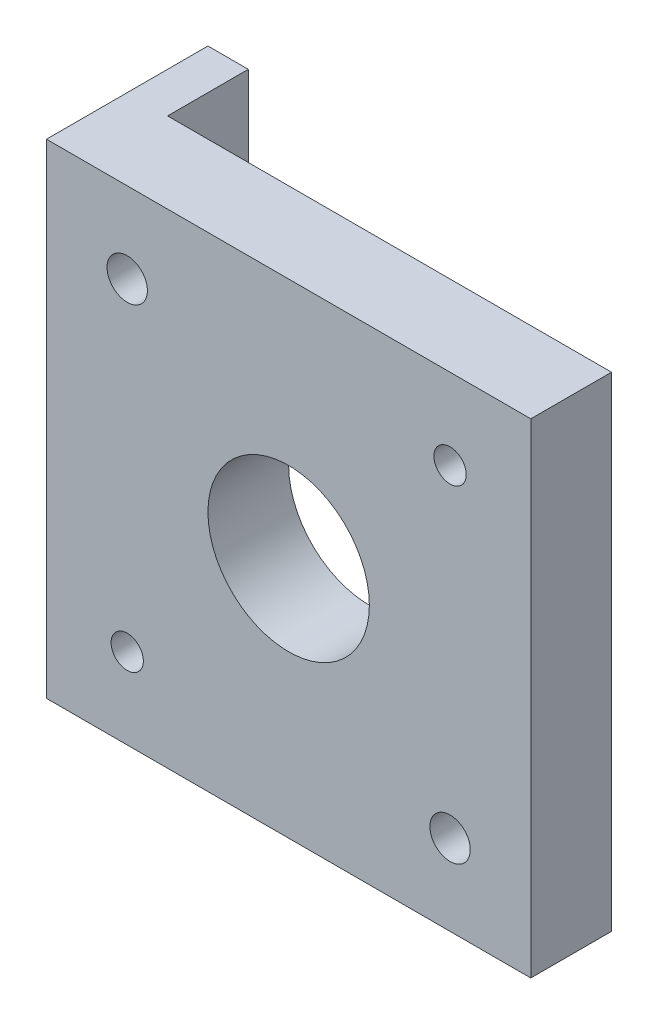
ISO-10303-21;
HEADER;
FILE_DESCRIPTION(('STEP AP214'),'2;1');
FILE_NAME('part.step','',(''),(''),'','','');
FILE_SCHEMA(('AUTOMOTIVE_DESIGN { 1 0 10303 214 1 1 1 1 }'));
ENDSEC;
DATA;
#1=APPLICATION_CONTEXT('core data for automotive mechanical design processes');
#2=APPLICATION_PROTOCOL_DEFINITION('international standard','automotive_design',2000,#1);
#3=PRODUCT_CONTEXT('',#1,'mechanical');
#4=PRODUCT('Part','Part','',(#3));
#5=PRODUCT_RELATED_PRODUCT_CATEGORY('part','',(#4));
#6=PRODUCT_DEFINITION_FORMATION('','',#4);
#7=PRODUCT_DEFINITION_CONTEXT('part definition',#1,'design');
#8=PRODUCT_DEFINITION('design','',#6,#7);
#9=PRODUCT_DEFINITION_SHAPE('','',#8);
#10=(LENGTH_UNIT() NAMED_UNIT(*) SI_UNIT(.MILLI.,.METRE.));
#11=(NAMED_UNIT(*) PLANE_ANGLE_UNIT() SI_UNIT($,.RADIAN.));
#12=(NAMED_UNIT(*) SI_UNIT($,.STERADIAN.) SOLID_ANGLE_UNIT());
#13=UNCERTAINTY_MEASURE_WITH_UNIT(LENGTH_MEASURE(1.E-05),#10,'distance_accuracy_value','');
#14=(GEOMETRIC_REPRESENTATION_CONTEXT(3) GLOBAL_UNCERTAINTY_ASSIGNED_CONTEXT((#13)) GLOBAL_UNIT_ASSIGNED_CONTEXT((#10,
#11,#12)) REPRESENTATION_CONTEXT('',''));
#15=CARTESIAN_POINT('',(0.,0.,0.));
#16=DIRECTION('',(0.,0.,1.));
#17=DIRECTION('',(1.,0.,0.));
#18=AXIS2_PLACEMENT_3D('',#15,#16,#17);
#19=CARTESIAN_POINT('',(0.,60.,10.));
#20=DIRECTION('',(0.,0.,-1.));
#21=DIRECTION('',(-1.,0.,0.));
#22=AXIS2_PLACEMENT_3D('',#19,#20,#21);
#23=PLANE('',#22);
#24=CARTESIAN_POINT('',(9.99999999999999,10.,10.));
#25=DIRECTION('',(0.,0.,1.));
#26=DIRECTION('',(1.,0.,0.));
#27=AXIS2_PLACEMENT_3D('',#24,#25,#26);
#28=CIRCLE('',#27,2.);
#29=CARTESIAN_POINT('',(12.,10.,10.));
#30=VERTEX_POINT('',#29);
#31=EDGE_CURVE('E363',#30,#30,#28,.T.);
#32=ORIENTED_EDGE('',*,*,#31,.F.);
#33=EDGE_LOOP('',(#32));
#34=FACE_BOUND('',#33,.T.);
#35=CARTESIAN_POINT('',(50.,50.,10.));
#36=DIRECTION('',(0.,0.,1.));
#37=DIRECTION('',(1.,0.,0.));
#38=AXIS2_PLACEMENT_3D('',#35,#36,#37);
#39=CIRCLE('',#38,2.);
#40=CARTESIAN_POINT('',(52.,50.,10.));
#41=VERTEX_POINT('',#40);
#42=EDGE_CURVE('E174',#41,#41,#39,.T.);
#43=ORIENTED_EDGE('',*,*,#42,.F.);
#44=EDGE_LOOP('',(#43));
#45=FACE_BOUND('',#44,.T.);
#46=CARTESIAN_POINT('',(9.99999999999993,49.9999999999999,10.000000000001));
#47=DIRECTION('',(0.,0.,-1.));
#48=DIRECTION('',(0.99716147316356,-0.0752927382838364,0.));
#49=AXIS2_PLACEMENT_3D('',#46,#47,#48);
#50=CIRCLE('',#49,2.5);
#51=CARTESIAN_POINT('',(12.4929036829088,49.8117681542903,10.000000000001));
#52=VERTEX_POINT('',#51);
#53=EDGE_CURVE('E171',#52,#52,#50,.T.);
#54=ORIENTED_EDGE('',*,*,#53,.T.);
#55=EDGE_LOOP('',(#54));
#56=FACE_BOUND('',#55,.T.);
#57=CARTESIAN_POINT('',(30.,30.,10.));
#58=DIRECTION('',(0.,0.,-1.));
#59=DIRECTION('',(-1.,0.,0.));
#60=AXIS2_PLACEMENT_3D('',#57,#58,#59);
#61=CIRCLE('',#60,10.);
#62=CARTESIAN_POINT('',(20.,30.,10.));
#63=VERTEX_POINT('',#62);
#64=EDGE_CURVE('E181',#63,#63,#61,.T.);
#65=ORIENTED_EDGE('',*,*,#64,.T.);
#66=EDGE_LOOP('',(#65));
#67=FACE_BOUND('',#66,.T.);
#68=DIRECTION('',(0.,-1.,0.));
#69=VECTOR('',#68,1.);
#70=CARTESIAN_POINT('',(0.,0.,10.));
#71=LINE('',#70,#69);
#72=CARTESIAN_POINT('',(0.,60.,10.));
#73=VERTEX_POINT('',#72);
#74=CARTESIAN_POINT('',(0.,0.,10.));
#75=VERTEX_POINT('',#74);
#76=EDGE_CURVE('E136',#73,#75,#71,.T.);
#77=ORIENTED_EDGE('',*,*,#76,.T.);
#78=DIRECTION('',(1.,0.,0.));
#79=VECTOR('',#78,1.);
#80=CARTESIAN_POINT('',(0.,0.,10.));
#81=LINE('',#80,#79);
#82=CARTESIAN_POINT('',(60.,0.,10.));
#83=VERTEX_POINT('',#82);
#84=EDGE_CURVE('E83',#75,#83,#81,.T.);
#85=ORIENTED_EDGE('',*,*,#84,.T.);
#86=DIRECTION('',(0.,1.,0.));
#87=VECTOR('',#86,1.);
#88=CARTESIAN_POINT('',(60.,0.,10.));
#89=LINE('',#88,#87);
#90=CARTESIAN_POINT('',(60.,60.,10.));
#91=VERTEX_POINT('',#90);
#92=EDGE_CURVE('E140',#83,#91,#89,.T.);
#93=ORIENTED_EDGE('',*,*,#92,.T.);
#94=DIRECTION('',(-1.,0.,0.));
#95=VECTOR('',#94,1.);
#96=CARTESIAN_POINT('',(0.,60.,10.));
#97=LINE('',#96,#95);
#98=EDGE_CURVE('E60',#91,#73,#97,.T.);
#99=ORIENTED_EDGE('',*,*,#98,.T.);
#100=EDGE_LOOP('',(#77,#85,#93,#99));
#101=FACE_BOUND('',#100,.T.);
#102=CARTESIAN_POINT('',(50.,10.,9.99999999999998));
#103=DIRECTION('',(0.,0.,-1.));
#104=DIRECTION('',(-0.107409040111746,0.994214915449509,0.));
#105=AXIS2_PLACEMENT_3D('',#102,#103,#104);
#106=CIRCLE('',#105,2.5);
#107=CARTESIAN_POINT('',(50.2685226002794,7.51446271137626,9.99999999999998));
#108=VERTEX_POINT('',#107);
#109=EDGE_CURVE('E165',#108,#108,#106,.T.);
#110=ORIENTED_EDGE('',*,*,#109,.T.);
#111=EDGE_LOOP('',(#110));
#112=FACE_BOUND('',#111,.T.);
#113=ADVANCED_FACE('F34',(#34,#45,#56,#67,#101,#112),#23,.F.);
#114=CARTESIAN_POINT('',(0.,60.,0.));
#115=DIRECTION('',(0.,0.,-1.));
#116=DIRECTION('',(-1.,0.,0.));
#117=AXIS2_PLACEMENT_3D('',#114,#115,#116);
#118=PLANE('',#117);
#119=CARTESIAN_POINT('',(9.99999999999999,10.,0.));
#120=DIRECTION('',(0.,0.,-1.));
#121=DIRECTION('',(-1.,0.,0.));
#122=AXIS2_PLACEMENT_3D('',#119,#120,#121);
#123=CIRCLE('',#122,2.);
#124=CARTESIAN_POINT('',(12.,10.,0.));
#125=VERTEX_POINT('',#124);
#126=EDGE_CURVE('E38',#125,#125,#123,.T.);
#127=ORIENTED_EDGE('',*,*,#126,.F.);
#128=EDGE_LOOP('',(#127));
#129=FACE_BOUND('',#128,.T.);
#130=CARTESIAN_POINT('',(50.,50.,0.));
#131=DIRECTION('',(0.,0.,-1.));
#132=DIRECTION('',(-1.,0.,0.));
#133=AXIS2_PLACEMENT_3D('',#130,#131,#132);
#134=CIRCLE('',#133,2.);
#135=CARTESIAN_POINT('',(52.,50.,0.));
#136=VERTEX_POINT('',#135);
#137=EDGE_CURVE('E168',#136,#136,#134,.T.);
#138=ORIENTED_EDGE('',*,*,#137,.F.);
#139=EDGE_LOOP('',(#138));
#140=FACE_BOUND('',#139,.T.);
#141=CARTESIAN_POINT('',(9.99999999999993,49.9999999999999,0.));
#142=DIRECTION('',(0.,0.,-1.));
#143=DIRECTION('',(-1.,0.,0.));
#144=AXIS2_PLACEMENT_3D('',#141,#142,#143);
#145=CIRCLE('',#144,2.5);
#146=CARTESIAN_POINT('',(7.49999999999993,49.9999999999999,0.));
#147=VERTEX_POINT('',#146);
#148=EDGE_CURVE('E180',#147,#147,#145,.F.);
#149=ORIENTED_EDGE('',*,*,#148,.T.);
#150=EDGE_LOOP('',(#149));
#151=FACE_BOUND('',#150,.T.);
#152=CARTESIAN_POINT('',(30.,30.,0.));
#153=DIRECTION('',(0.,0.,-1.));
#154=DIRECTION('',(-1.,0.,0.));
#155=AXIS2_PLACEMENT_3D('',#152,#153,#154);
#156=CIRCLE('',#155,10.);
#157=CARTESIAN_POINT('',(20.,30.,0.));
#158=VERTEX_POINT('',#157);
#159=EDGE_CURVE('E185',#158,#158,#156,.T.);
#160=ORIENTED_EDGE('',*,*,#159,.F.);
#161=EDGE_LOOP('',(#160));
#162=FACE_BOUND('',#161,.T.);
#163=DIRECTION('',(0.,-1.,0.));
#164=VECTOR('',#163,1.);
#165=CARTESIAN_POINT('',(5.,60.,0.));
#166=LINE('',#165,#164);
#167=CARTESIAN_POINT('',(4.99999999999999,60.,0.));
#168=VERTEX_POINT('',#167);
#169=CARTESIAN_POINT('',(4.99999999999999,0.,0.));
#170=VERTEX_POINT('',#169);
#171=EDGE_CURVE('E51',#168,#170,#166,.T.);
#172=ORIENTED_EDGE('',*,*,#171,.F.);
#173=DIRECTION('',(-1.,0.,0.));
#174=VECTOR('',#173,1.);
#175=CARTESIAN_POINT('',(0.,60.,0.));
#176=LINE('',#175,#174);
#177=CARTESIAN_POINT('',(60.,60.,0.));
#178=VERTEX_POINT('',#177);
#179=EDGE_CURVE('E138',#178,#168,#176,.T.);
#180=ORIENTED_EDGE('',*,*,#179,.F.);
#181=DIRECTION('',(0.,1.,0.));
#182=VECTOR('',#181,1.);
#183=CARTESIAN_POINT('',(60.,0.,0.));
#184=LINE('',#183,#182);
#185=CARTESIAN_POINT('',(60.,0.,0.));
#186=VERTEX_POINT('',#185);
#187=EDGE_CURVE('E76',#186,#178,#184,.T.);
#188=ORIENTED_EDGE('',*,*,#187,.F.);
#189=DIRECTION('',(1.,0.,0.));
#190=VECTOR('',#189,1.);
#191=CARTESIAN_POINT('',(0.,0.,0.));
#192=LINE('',#191,#190);
#193=EDGE_CURVE('E119',#170,#186,#192,.T.);
#194=ORIENTED_EDGE('',*,*,#193,.F.);
#195=EDGE_LOOP('',(#172,#180,#188,#194));
#196=FACE_BOUND('',#195,.T.);
#197=CARTESIAN_POINT('',(50.,10.,0.));
#198=DIRECTION('',(0.,0.,-1.));
#199=DIRECTION('',(-1.,0.,0.));
#200=AXIS2_PLACEMENT_3D('',#197,#198,#199);
#201=CIRCLE('',#200,2.5);
#202=CARTESIAN_POINT('',(50.2685226002794,7.51446271137626,0.));
#203=VERTEX_POINT('',#202);
#204=EDGE_CURVE('E167',#203,#203,#201,.F.);
#205=ORIENTED_EDGE('',*,*,#204,.T.);
#206=EDGE_LOOP('',(#205));
#207=FACE_BOUND('',#206,.T.);
#208=ADVANCED_FACE('F155',(#129,#140,#151,#162,#196,#207),#118,.T.);
#209=CARTESIAN_POINT('',(0.,0.,10.));
#210=DIRECTION('',(1.,0.,0.));
#211=DIRECTION('',(0.,1.,0.));
#212=AXIS2_PLACEMENT_3D('',#209,#210,#211);
#213=PLANE('',#212);
#214=CARTESIAN_POINT('',(0.,10.,-6.));
#215=DIRECTION('',(-1.,0.,0.));
#216=DIRECTION('',(0.,0.,1.));
#217=AXIS2_PLACEMENT_3D('',#214,#215,#216);
#218=CIRCLE('',#217,2.);
#219=CARTESIAN_POINT('',(0.,10.,-4.));
#220=VERTEX_POINT('',#219);
#221=EDGE_CURVE('E184',#220,#220,#218,.T.);
#222=ORIENTED_EDGE('',*,*,#221,.F.);
#223=EDGE_LOOP('',(#222));
#224=FACE_BOUND('',#223,.T.);
#225=CARTESIAN_POINT('',(0.,50.,-6.));
#226=DIRECTION('',(-1.,0.,0.));
#227=DIRECTION('',(0.,0.,1.));
#228=AXIS2_PLACEMENT_3D('',#225,#226,#227);
#229=CIRCLE('',#228,2.);
#230=CARTESIAN_POINT('',(0.,50.,-4.));
#231=VERTEX_POINT('',#230);
#232=EDGE_CURVE('E191',#231,#231,#229,.T.);
#233=ORIENTED_EDGE('',*,*,#232,.F.);
#234=EDGE_LOOP('',(#233));
#235=FACE_BOUND('',#234,.T.);
#236=DIRECTION('',(0.,0.,-1.));
#237=VECTOR('',#236,1.);
#238=CARTESIAN_POINT('',(0.,60.,10.));
#239=LINE('',#238,#237);
#240=CARTESIAN_POINT('',(0.,60.,-10.));
#241=VERTEX_POINT('',#240);
#242=EDGE_CURVE('E142',#73,#241,#239,.T.);
#243=ORIENTED_EDGE('',*,*,#242,.T.);
#244=DIRECTION('',(0.,1.,0.));
#245=VECTOR('',#244,1.);
#246=CARTESIAN_POINT('',(0.,60.,-10.));
#247=LINE('',#246,#245);
#248=CARTESIAN_POINT('',(0.,0.,-10.));
#249=VERTEX_POINT('',#248);
#250=EDGE_CURVE('E107',#249,#241,#247,.T.);
#251=ORIENTED_EDGE('',*,*,#250,.F.);
#252=DIRECTION('',(0.,0.,-1.));
#253=VECTOR('',#252,1.);
#254=CARTESIAN_POINT('',(0.,0.,10.));
#255=LINE('',#254,#253);
#256=EDGE_CURVE('E11',#75,#249,#255,.T.);
#257=ORIENTED_EDGE('',*,*,#256,.F.);
#258=ORIENTED_EDGE('',*,*,#76,.F.);
#259=EDGE_LOOP('',(#243,#251,#257,#258));
#260=FACE_BOUND('',#259,.T.);
#261=ADVANCED_FACE('F36',(#224,#235,#260),#213,.F.);
#262=CARTESIAN_POINT('',(0.,0.,10.));
#263=DIRECTION('',(0.,1.,0.));
#264=DIRECTION('',(0.,0.,1.));
#265=AXIS2_PLACEMENT_3D('',#262,#263,#264);
#266=PLANE('',#265);
#267=ORIENTED_EDGE('',*,*,#256,.T.);
#268=DIRECTION('',(-1.,0.,0.));
#269=VECTOR('',#268,1.);
#270=CARTESIAN_POINT('',(4.99999999999999,0.,-10.));
#271=LINE('',#270,#269);
#272=CARTESIAN_POINT('',(4.99999999999999,0.,-10.));
#273=VERTEX_POINT('',#272);
#274=EDGE_CURVE('E98',#273,#249,#271,.T.);
#275=ORIENTED_EDGE('',*,*,#274,.F.);
#276=DIRECTION('',(0.,0.,1.));
#277=VECTOR('',#276,1.);
#278=CARTESIAN_POINT('',(4.99999999999999,0.,-10.));
#279=LINE('',#278,#277);
#280=EDGE_CURVE('E102',#273,#170,#279,.T.);
#281=ORIENTED_EDGE('',*,*,#280,.T.);
#282=ORIENTED_EDGE('',*,*,#193,.T.);
#283=DIRECTION('',(0.,0.,-1.));
#284=VECTOR('',#283,1.);
#285=CARTESIAN_POINT('',(60.,0.,10.));
#286=LINE('',#285,#284);
#287=EDGE_CURVE('E43',#83,#186,#286,.T.);
#288=ORIENTED_EDGE('',*,*,#287,.F.);
#289=ORIENTED_EDGE('',*,*,#84,.F.);
#290=EDGE_LOOP('',(#267,#275,#281,#282,#288,#289));
#291=FACE_BOUND('',#290,.T.);
#292=ADVANCED_FACE('F100',(#291),#266,.F.);
#293=CARTESIAN_POINT('',(60.,0.,10.));
#294=DIRECTION('',(-1.,0.,0.));
#295=DIRECTION('',(0.,-1.,0.));
#296=AXIS2_PLACEMENT_3D('',#293,#294,#295);
#297=PLANE('',#296);
#298=ORIENTED_EDGE('',*,*,#187,.T.);
#299=DIRECTION('',(0.,0.,-1.));
#300=VECTOR('',#299,1.);
#301=CARTESIAN_POINT('',(60.,60.,10.));
#302=LINE('',#301,#300);
#303=EDGE_CURVE('E150',#91,#178,#302,.T.);
#304=ORIENTED_EDGE('',*,*,#303,.F.);
#305=ORIENTED_EDGE('',*,*,#92,.F.);
#306=ORIENTED_EDGE('',*,*,#287,.T.);
#307=EDGE_LOOP('',(#298,#304,#305,#306));
#308=FACE_BOUND('',#307,.T.);
#309=ADVANCED_FACE('F158',(#308),#297,.F.);
#310=CARTESIAN_POINT('',(0.,60.,10.));
#311=DIRECTION('',(0.,-1.,0.));
#312=DIRECTION('',(0.,0.,-1.));
#313=AXIS2_PLACEMENT_3D('',#310,#311,#312);
#314=PLANE('',#313);
#315=ORIENTED_EDGE('',*,*,#179,.T.);
#316=DIRECTION('',(0.,0.,1.));
#317=VECTOR('',#316,1.);
#318=CARTESIAN_POINT('',(5.,60.,-10.));
#319=LINE('',#318,#317);
#320=CARTESIAN_POINT('',(5.,60.,-10.));
#321=VERTEX_POINT('',#320);
#322=EDGE_CURVE('E120',#321,#168,#319,.T.);
#323=ORIENTED_EDGE('',*,*,#322,.F.);
#324=DIRECTION('',(1.,0.,0.));
#325=VECTOR('',#324,1.);
#326=CARTESIAN_POINT('',(5.,60.,-10.));
#327=LINE('',#326,#325);
#328=EDGE_CURVE('E113',#241,#321,#327,.T.);
#329=ORIENTED_EDGE('',*,*,#328,.F.);
#330=ORIENTED_EDGE('',*,*,#242,.F.);
#331=ORIENTED_EDGE('',*,*,#98,.F.);
#332=ORIENTED_EDGE('',*,*,#303,.T.);
#333=EDGE_LOOP('',(#315,#323,#329,#330,#331,#332));
#334=FACE_BOUND('',#333,.T.);
#335=ADVANCED_FACE('F154',(#334),#314,.F.);
#336=CARTESIAN_POINT('',(5.,60.,-10.));
#337=DIRECTION('',(-1.,0.,0.));
#338=DIRECTION('',(0.,-1.,0.));
#339=AXIS2_PLACEMENT_3D('',#336,#337,#338);
#340=PLANE('',#339);
#341=CARTESIAN_POINT('',(4.99999999999999,10.,-6.));
#342=DIRECTION('',(-1.,0.,0.));
#343=DIRECTION('',(0.,-1.,0.));
#344=AXIS2_PLACEMENT_3D('',#341,#342,#343);
#345=CIRCLE('',#344,2.);
#346=CARTESIAN_POINT('',(4.99999999999999,10.,-4.));
#347=VERTEX_POINT('',#346);
#348=EDGE_CURVE('E190',#347,#347,#345,.T.);
#349=ORIENTED_EDGE('',*,*,#348,.T.);
#350=EDGE_LOOP('',(#349));
#351=FACE_BOUND('',#350,.T.);
#352=CARTESIAN_POINT('',(5.,50.,-6.));
#353=DIRECTION('',(-1.,0.,0.));
#354=DIRECTION('',(0.,-1.,0.));
#355=AXIS2_PLACEMENT_3D('',#352,#353,#354);
#356=CIRCLE('',#355,2.);
#357=CARTESIAN_POINT('',(5.,50.,-4.));
#358=VERTEX_POINT('',#357);
#359=EDGE_CURVE('E130',#358,#358,#356,.T.);
#360=ORIENTED_EDGE('',*,*,#359,.T.);
#361=EDGE_LOOP('',(#360));
#362=FACE_BOUND('',#361,.T.);
#363=ORIENTED_EDGE('',*,*,#171,.T.);
#364=ORIENTED_EDGE('',*,*,#280,.F.);
#365=DIRECTION('',(0.,-1.,0.));
#366=VECTOR('',#365,1.);
#367=CARTESIAN_POINT('',(5.,60.,-10.));
#368=LINE('',#367,#366);
#369=EDGE_CURVE('E108',#321,#273,#368,.T.);
#370=ORIENTED_EDGE('',*,*,#369,.F.);
#371=ORIENTED_EDGE('',*,*,#322,.T.);
#372=EDGE_LOOP('',(#363,#364,#370,#371));
#373=FACE_BOUND('',#372,.T.);
#374=ADVANCED_FACE('F118',(#351,#362,#373),#340,.F.);
#375=CARTESIAN_POINT('',(4.99999999999999,0.,-10.));
#376=DIRECTION('',(0.,0.,-1.));
#377=DIRECTION('',(-1.,0.,0.));
#378=AXIS2_PLACEMENT_3D('',#375,#376,#377);
#379=PLANE('',#378);
#380=ORIENTED_EDGE('',*,*,#369,.T.);
#381=ORIENTED_EDGE('',*,*,#274,.T.);
#382=ORIENTED_EDGE('',*,*,#250,.T.);
#383=ORIENTED_EDGE('',*,*,#328,.T.);
#384=EDGE_LOOP('',(#380,#381,#382,#383));
#385=FACE_BOUND('',#384,.T.);
#386=ADVANCED_FACE('F111',(#385),#379,.T.);
#387=CARTESIAN_POINT('',(60.000025,50.,-6.));
#388=DIRECTION('',(-1.,0.,0.));
#389=DIRECTION('',(0.,0.,1.));
#390=AXIS2_PLACEMENT_3D('',#387,#388,#389);
#391=CYLINDRICAL_SURFACE('',#390,2.);
#392=CARTESIAN_POINT('',(0.,50.,-4.));
#393=CARTESIAN_POINT('',(0.0520833333333322,50.,-4.));
#394=CARTESIAN_POINT('',(0.104166666666664,50.,-4.));
#395=CARTESIAN_POINT('',(0.208333333333331,50.,-4.));
#396=CARTESIAN_POINT('',(0.260416666666666,50.,-4.));
#397=CARTESIAN_POINT('',(0.364583333333335,50.,-4.));
#398=CARTESIAN_POINT('',(0.416666666666669,50.,-4.));
#399=CARTESIAN_POINT('',(0.520833333333336,50.,-4.));
#400=CARTESIAN_POINT('',(0.572916666666668,50.,-4.));
#401=CARTESIAN_POINT('',(0.677083333333333,50.,-4.));
#402=CARTESIAN_POINT('',(0.729166666666665,50.,-4.));
#403=CARTESIAN_POINT('',(0.833333333333332,50.,-4.));
#404=CARTESIAN_POINT('',(0.885416666666666,50.,-4.));
#405=CARTESIAN_POINT('',(0.989583333333335,50.,-4.));
#406=CARTESIAN_POINT('',(1.04166666666667,50.,-4.));
#407=CARTESIAN_POINT('',(1.14583333333334,50.,-4.));
#408=CARTESIAN_POINT('',(1.19791666666667,50.,-4.));
#409=CARTESIAN_POINT('',(1.30208333333333,50.,-4.));
#410=CARTESIAN_POINT('',(1.35416666666667,50.,-4.));
#411=CARTESIAN_POINT('',(1.45833333333333,50.,-4.));
#412=CARTESIAN_POINT('',(1.51041666666667,50.,-4.));
#413=CARTESIAN_POINT('',(1.61458333333334,50.,-4.));
#414=CARTESIAN_POINT('',(1.66666666666667,50.,-4.));
#415=CARTESIAN_POINT('',(1.77083333333334,50.,-4.));
#416=CARTESIAN_POINT('',(1.82291666666667,50.,-4.));
#417=CARTESIAN_POINT('',(1.92708333333333,50.,-4.));
#418=CARTESIAN_POINT('',(1.97916666666667,50.,-4.));
#419=CARTESIAN_POINT('',(2.08333333333333,50.,-4.));
#420=CARTESIAN_POINT('',(2.13541666666667,50.,-4.));
#421=CARTESIAN_POINT('',(2.23958333333334,50.,-4.));
#422=CARTESIAN_POINT('',(2.29166666666667,50.,-4.));
#423=CARTESIAN_POINT('',(2.39583333333334,50.,-4.));
#424=CARTESIAN_POINT('',(2.44791666666667,50.,-4.));
#425=CARTESIAN_POINT('',(2.55208333333333,50.,-4.));
#426=CARTESIAN_POINT('',(2.60416666666667,50.,-4.));
#427=CARTESIAN_POINT('',(2.70833333333333,50.,-4.));
#428=CARTESIAN_POINT('',(2.76041666666667,50.,-4.));
#429=CARTESIAN_POINT('',(2.86458333333334,50.,-4.));
#430=CARTESIAN_POINT('',(2.91666666666667,50.,-4.));
#431=CARTESIAN_POINT('',(3.02083333333334,50.,-4.));
#432=CARTESIAN_POINT('',(3.07291666666667,50.,-4.));
#433=CARTESIAN_POINT('',(3.17708333333334,50.,-4.));
#434=CARTESIAN_POINT('',(3.22916666666667,50.,-4.));
#435=CARTESIAN_POINT('',(3.33333333333333,50.,-4.));
#436=CARTESIAN_POINT('',(3.38541666666667,50.,-4.));
#437=CARTESIAN_POINT('',(3.48958333333334,50.,-4.));
#438=CARTESIAN_POINT('',(3.54166666666667,50.,-4.));
#439=CARTESIAN_POINT('',(3.64583333333334,50.,-4.));
#440=CARTESIAN_POINT('',(3.69791666666667,50.,-4.));
#441=CARTESIAN_POINT('',(3.80208333333334,50.,-4.));
#442=CARTESIAN_POINT('',(3.85416666666667,50.,-4.));
#443=CARTESIAN_POINT('',(3.95833333333333,50.,-4.));
#444=CARTESIAN_POINT('',(4.01041666666667,50.,-4.));
#445=CARTESIAN_POINT('',(4.11458333333334,50.,-4.));
#446=CARTESIAN_POINT('',(4.16666666666667,50.,-4.));
#447=CARTESIAN_POINT('',(4.27083333333334,50.,-4.));
#448=CARTESIAN_POINT('',(4.32291666666667,50.,-4.));
#449=CARTESIAN_POINT('',(4.42708333333334,50.,-4.));
#450=CARTESIAN_POINT('',(4.47916666666667,50.,-4.));
#451=CARTESIAN_POINT('',(4.58333333333333,50.,-4.));
#452=CARTESIAN_POINT('',(4.63541666666667,50.,-4.));
#453=CARTESIAN_POINT('',(4.73958333333334,50.,-4.));
#454=CARTESIAN_POINT('',(4.79166666666667,50.,-4.));
#455=CARTESIAN_POINT('',(4.89583333333334,50.,-4.));
#456=CARTESIAN_POINT('',(4.94791666666667,50.,-4.));
#457=CARTESIAN_POINT('',(5.,50.,-4.));
#458=B_SPLINE_CURVE_WITH_KNOTS('',3,(#392,#393,#394,#395,#396,#397,#398,#399,#400,#401,#402,
#403,#404,#405,#406,#407,#408,#409,#410,#411,#412,#413,#414,#415,#416,#417,#418,#419,#420,#421,
#422,#423,#424,#425,#426,#427,#428,#429,#430,#431,#432,#433,#434,#435,#436,#437,#438,#439,#440,
#441,#442,#443,#444,#445,#446,#447,#448,#449,#450,#451,#452,#453,#454,#455,#456,#457),
.UNSPECIFIED.,.F.,.F.,(4,2,2,2,2,2,2,2,2,2,2,2,2,2,2,2,2,2,2,2,2,2,2,2,2,2,2,2,2,2,2,2,4),(0.,
0.156249999999997,0.3125,0.468750000000004,0.625000000000001,0.781249999999997,
0.937500000000001,1.09375,1.25,1.40625,1.5625,1.71875,1.875,2.03125,2.1875,2.34375000000001,2.5,
2.65625,2.8125,2.96875000000001,3.125,3.28125,3.4375,3.59375000000001,3.75,3.90625,4.0625,
4.21875000000001,4.375,4.53125,4.6875,4.84375000000001,5.),.UNSPECIFIED.);
#459=EDGE_CURVE('BSEAM264',#231,#358,#458,.T.);
#460=ORIENTED_EDGE('',*,*,#232,.T.);
#461=ORIENTED_EDGE('',*,*,#359,.F.);
#462=ORIENTED_EDGE('',*,*,#459,.T.);
#463=ORIENTED_EDGE('',*,*,#459,.F.);
#464=EDGE_LOOP('',(#460,#462,#461,#463));
#465=FACE_BOUND('',#464,.T.);
#466=ADVANCED_FACE('F264',(#465),#391,.F.);
#467=CARTESIAN_POINT('',(60.000025,10.,-6.));
#468=DIRECTION('',(-1.,0.,0.));
#469=DIRECTION('',(0.,0.,1.));
#470=AXIS2_PLACEMENT_3D('',#467,#468,#469);
#471=CYLINDRICAL_SURFACE('',#470,2.);
#472=CARTESIAN_POINT('',(0.,10.,-4.));
#473=CARTESIAN_POINT('',(0.0520833333333322,10.,-4.));
#474=CARTESIAN_POINT('',(0.104166666666664,10.,-4.));
#475=CARTESIAN_POINT('',(0.208333333333331,10.,-4.));
#476=CARTESIAN_POINT('',(0.260416666666666,10.,-4.));
#477=CARTESIAN_POINT('',(0.364583333333332,10.,-4.));
#478=CARTESIAN_POINT('',(0.416666666666665,10.,-4.));
#479=CARTESIAN_POINT('',(0.520833333333331,10.,-4.));
#480=CARTESIAN_POINT('',(0.572916666666666,10.,-4.));
#481=CARTESIAN_POINT('',(0.677083333333333,10.,-4.));
#482=CARTESIAN_POINT('',(0.729166666666665,10.,-4.));
#483=CARTESIAN_POINT('',(0.833333333333332,10.,-4.));
#484=CARTESIAN_POINT('',(0.885416666666666,10.,-4.));
#485=CARTESIAN_POINT('',(0.989583333333333,10.,-4.));
#486=CARTESIAN_POINT('',(1.04166666666667,10.,-4.));
#487=CARTESIAN_POINT('',(1.14583333333333,10.,-4.));
#488=CARTESIAN_POINT('',(1.19791666666667,10.,-4.));
#489=CARTESIAN_POINT('',(1.30208333333333,10.,-4.));
#490=CARTESIAN_POINT('',(1.35416666666667,10.,-4.));
#491=CARTESIAN_POINT('',(1.45833333333333,10.,-4.));
#492=CARTESIAN_POINT('',(1.51041666666666,10.,-4.));
#493=CARTESIAN_POINT('',(1.61458333333333,10.,-4.));
#494=CARTESIAN_POINT('',(1.66666666666666,10.,-4.));
#495=CARTESIAN_POINT('',(1.77083333333333,10.,-4.));
#496=CARTESIAN_POINT('',(1.82291666666666,10.,-4.));
#497=CARTESIAN_POINT('',(1.92708333333333,10.,-4.));
#498=CARTESIAN_POINT('',(1.97916666666666,10.,-4.));
#499=CARTESIAN_POINT('',(2.08333333333333,10.,-4.));
#500=CARTESIAN_POINT('',(2.13541666666666,10.,-4.));
#501=CARTESIAN_POINT('',(2.23958333333333,10.,-4.));
#502=CARTESIAN_POINT('',(2.29166666666666,10.,-4.));
#503=CARTESIAN_POINT('',(2.39583333333333,10.,-4.));
#504=CARTESIAN_POINT('',(2.44791666666666,10.,-4.));
#505=CARTESIAN_POINT('',(2.55208333333333,10.,-4.));
#506=CARTESIAN_POINT('',(2.60416666666666,10.,-4.));
#507=CARTESIAN_POINT('',(2.70833333333333,10.,-4.));
#508=CARTESIAN_POINT('',(2.76041666666666,10.,-4.));
#509=CARTESIAN_POINT('',(2.86458333333333,10.,-4.));
#510=CARTESIAN_POINT('',(2.91666666666666,10.,-4.));
#511=CARTESIAN_POINT('',(3.02083333333333,10.,-4.));
#512=CARTESIAN_POINT('',(3.07291666666666,10.,-4.));
#513=CARTESIAN_POINT('',(3.17708333333333,10.,-4.));
#514=CARTESIAN_POINT('',(3.22916666666666,10.,-4.));
#515=CARTESIAN_POINT('',(3.33333333333333,10.,-4.));
#516=CARTESIAN_POINT('',(3.38541666666666,10.,-4.));
#517=CARTESIAN_POINT('',(3.48958333333333,10.,-4.));
#518=CARTESIAN_POINT('',(3.54166666666666,10.,-4.));
#519=CARTESIAN_POINT('',(3.64583333333333,10.,-4.));
#520=CARTESIAN_POINT('',(3.69791666666666,10.,-4.));
#521=CARTESIAN_POINT('',(3.80208333333332,10.,-4.));
#522=CARTESIAN_POINT('',(3.85416666666666,10.,-4.));
#523=CARTESIAN_POINT('',(3.95833333333333,10.,-4.));
#524=CARTESIAN_POINT('',(4.01041666666666,10.,-4.));
#525=CARTESIAN_POINT('',(4.11458333333332,10.,-4.));
#526=CARTESIAN_POINT('',(4.16666666666666,10.,-4.));
#527=CARTESIAN_POINT('',(4.27083333333333,10.,-4.));
#528=CARTESIAN_POINT('',(4.32291666666666,10.,-4.));
#529=CARTESIAN_POINT('',(4.42708333333332,10.,-4.));
#530=CARTESIAN_POINT('',(4.47916666666666,10.,-4.));
#531=CARTESIAN_POINT('',(4.58333333333333,10.,-4.));
#532=CARTESIAN_POINT('',(4.63541666666666,10.,-4.));
#533=CARTESIAN_POINT('',(4.73958333333333,10.,-4.));
#534=CARTESIAN_POINT('',(4.79166666666666,10.,-4.));
#535=CARTESIAN_POINT('',(4.89583333333333,10.,-4.));
#536=CARTESIAN_POINT('',(4.94791666666666,10.,-4.));
#537=CARTESIAN_POINT('',(4.99999999999999,10.,-4.));
#538=B_SPLINE_CURVE_WITH_KNOTS('',3,(#472,#473,#474,#475,#476,#477,#478,#479,#480,#481,#482,
#483,#484,#485,#486,#487,#488,#489,#490,#491,#492,#493,#494,#495,#496,#497,#498,#499,#500,#501,
#502,#503,#504,#505,#506,#507,#508,#509,#510,#511,#512,#513,#514,#515,#516,#517,#518,#519,#520,
#521,#522,#523,#524,#525,#526,#527,#528,#529,#530,#531,#532,#533,#534,#535,#536,#537),
.UNSPECIFIED.,.F.,.F.,(4,2,2,2,2,2,2,2,2,2,2,2,2,2,2,2,2,2,2,2,2,2,2,2,2,2,2,2,2,2,2,2,4),(0.,
0.156249999999997,0.3125,0.468749999999997,0.625000000000001,0.781249999999997,
0.937500000000001,1.09375,1.25,1.40625,1.56249999999999,1.71875,1.87499999999999,2.03125,2.1875,
2.34375,2.5,2.65624999999999,2.8125,2.96874999999999,3.125,3.28124999999999,3.4375,
3.59374999999999,3.74999999999999,3.90624999999999,4.06249999999999,4.21874999999999,
4.37499999999999,4.53124999999999,4.68749999999999,4.84374999999999,4.99999999999999),.UNSPECIFIED.);
#539=EDGE_CURVE('BSEAM220',#220,#347,#538,.T.);
#540=ORIENTED_EDGE('',*,*,#221,.T.);
#541=ORIENTED_EDGE('',*,*,#348,.F.);
#542=ORIENTED_EDGE('',*,*,#539,.T.);
#543=ORIENTED_EDGE('',*,*,#539,.F.);
#544=EDGE_LOOP('',(#540,#542,#541,#543));
#545=FACE_BOUND('',#544,.T.);
#546=ADVANCED_FACE('F220',(#545),#471,.F.);
#547=CARTESIAN_POINT('',(30.,30.,10.));
#548=DIRECTION('',(0.,0.,-1.));
#549=DIRECTION('',(-1.,0.,0.));
#550=AXIS2_PLACEMENT_3D('',#547,#548,#549);
#551=CYLINDRICAL_SURFACE('',#550,10.);
#552=ORIENTED_EDGE('',*,*,#64,.F.);
#553=EDGE_LOOP('',(#552));
#554=FACE_BOUND('',#553,.T.);
#555=ORIENTED_EDGE('',*,*,#159,.T.);
#556=EDGE_LOOP('',(#555));
#557=FACE_BOUND('',#556,.T.);
#558=ADVANCED_FACE('F211',(#554,#557),#551,.F.);
#559=CARTESIAN_POINT('',(9.99999999999993,49.9999999999999,-109.999999999999));
#560=DIRECTION('',(0.,0.,1.));
#561=DIRECTION('',(-0.99716147316356,0.0752927382838364,0.));
#562=AXIS2_PLACEMENT_3D('',#559,#560,#561);
#563=CYLINDRICAL_SURFACE('',#562,2.5);
#564=ORIENTED_EDGE('',*,*,#148,.F.);
#565=EDGE_LOOP('',(#564));
#566=FACE_BOUND('',#565,.T.);
#567=ORIENTED_EDGE('',*,*,#53,.F.);
#568=EDGE_LOOP('',(#567));
#569=FACE_BOUND('',#568,.T.);
#570=ADVANCED_FACE('F207',(#566,#569),#563,.F.);
#571=CARTESIAN_POINT('',(50.,10.,-110.));
#572=DIRECTION('',(0.,0.,1.));
#573=DIRECTION('',(0.107409040111746,-0.994214915449509,0.));
#574=AXIS2_PLACEMENT_3D('',#571,#572,#573);
#575=CYLINDRICAL_SURFACE('',#574,2.5);
#576=CARTESIAN_POINT('',(50.2685226002794,7.51446271137626,0.));
#577=CARTESIAN_POINT('',(50.2685226002794,7.51446271137626,0.104166666666664));
#578=CARTESIAN_POINT('',(50.2685226002794,7.51446271137626,0.208333333333329));
#579=CARTESIAN_POINT('',(50.2685226002794,7.51446271137626,0.416666666666662));
#580=CARTESIAN_POINT('',(50.2685226002794,7.51446271137626,0.520833333333331));
#581=CARTESIAN_POINT('',(50.2685226002794,7.51446271137626,0.729166666666665));
#582=CARTESIAN_POINT('',(50.2685226002794,7.51446271137626,0.833333333333329));
#583=CARTESIAN_POINT('',(50.2685226002794,7.51446271137626,1.04166666666666));
#584=CARTESIAN_POINT('',(50.2685226002794,7.51446271137626,1.14583333333333));
#585=CARTESIAN_POINT('',(50.2685226002794,7.51446271137626,1.35416666666667));
#586=CARTESIAN_POINT('',(50.2685226002794,7.51446271137626,1.45833333333333));
#587=CARTESIAN_POINT('',(50.2685226002794,7.51446271137626,1.66666666666666));
#588=CARTESIAN_POINT('',(50.2685226002794,7.51446271137626,1.77083333333333));
#589=CARTESIAN_POINT('',(50.2685226002794,7.51446271137626,1.97916666666667));
#590=CARTESIAN_POINT('',(50.2685226002794,7.51446271137626,2.08333333333333));
#591=CARTESIAN_POINT('',(50.2685226002794,7.51446271137626,2.29166666666666));
#592=CARTESIAN_POINT('',(50.2685226002794,7.51446271137626,2.39583333333333));
#593=CARTESIAN_POINT('',(50.2685226002794,7.51446271137626,2.60416666666667));
#594=CARTESIAN_POINT('',(50.2685226002794,7.51446271137626,2.70833333333333));
#595=CARTESIAN_POINT('',(50.2685226002794,7.51446271137626,2.91666666666666));
#596=CARTESIAN_POINT('',(50.2685226002794,7.51446271137626,3.02083333333332));
#597=CARTESIAN_POINT('',(50.2685226002794,7.51446271137626,3.22916666666666));
#598=CARTESIAN_POINT('',(50.2685226002794,7.51446271137626,3.33333333333333));
#599=CARTESIAN_POINT('',(50.2685226002794,7.51446271137626,3.54166666666666));
#600=CARTESIAN_POINT('',(50.2685226002794,7.51446271137626,3.64583333333333));
#601=CARTESIAN_POINT('',(50.2685226002794,7.51446271137626,3.85416666666666));
#602=CARTESIAN_POINT('',(50.2685226002794,7.51446271137626,3.95833333333333));
#603=CARTESIAN_POINT('',(50.2685226002794,7.51446271137626,4.16666666666666));
#604=CARTESIAN_POINT('',(50.2685226002794,7.51446271137626,4.27083333333333));
#605=CARTESIAN_POINT('',(50.2685226002794,7.51446271137626,4.47916666666666));
#606=CARTESIAN_POINT('',(50.2685226002794,7.51446271137626,4.58333333333333));
#607=CARTESIAN_POINT('',(50.2685226002794,7.51446271137626,4.79166666666666));
#608=CARTESIAN_POINT('',(50.2685226002794,7.51446271137626,4.89583333333333));
#609=CARTESIAN_POINT('',(50.2685226002794,7.51446271137626,5.10416666666666));
#610=CARTESIAN_POINT('',(50.2685226002794,7.51446271137626,5.20833333333332));
#611=CARTESIAN_POINT('',(50.2685226002794,7.51446271137626,5.41666666666665));
#612=CARTESIAN_POINT('',(50.2685226002794,7.51446271137626,5.52083333333332));
#613=CARTESIAN_POINT('',(50.2685226002794,7.51446271137626,5.72916666666666));
#614=CARTESIAN_POINT('',(50.2685226002794,7.51446271137626,5.83333333333332));
#615=CARTESIAN_POINT('',(50.2685226002794,7.51446271137626,6.04166666666665));
#616=CARTESIAN_POINT('',(50.2685226002794,7.51446271137626,6.14583333333332));
#617=CARTESIAN_POINT('',(50.2685226002794,7.51446271137626,6.35416666666666));
#618=CARTESIAN_POINT('',(50.2685226002794,7.51446271137626,6.45833333333332));
#619=CARTESIAN_POINT('',(50.2685226002794,7.51446271137626,6.66666666666665));
#620=CARTESIAN_POINT('',(50.2685226002794,7.51446271137626,6.77083333333332));
#621=CARTESIAN_POINT('',(50.2685226002794,7.51446271137626,6.97916666666666));
#622=CARTESIAN_POINT('',(50.2685226002794,7.51446271137626,7.08333333333332));
#623=CARTESIAN_POINT('',(50.2685226002794,7.51446271137626,7.29166666666665));
#624=CARTESIAN_POINT('',(50.2685226002794,7.51446271137626,7.39583333333331));
#625=CARTESIAN_POINT('',(50.2685226002794,7.51446271137626,7.60416666666665));
#626=CARTESIAN_POINT('',(50.2685226002794,7.51446271137626,7.70833333333332));
#627=CARTESIAN_POINT('',(50.2685226002794,7.51446271137626,7.91666666666665));
#628=CARTESIAN_POINT('',(50.2685226002794,7.51446271137626,8.02083333333332));
#629=CARTESIAN_POINT('',(50.2685226002794,7.51446271137626,8.22916666666665));
#630=CARTESIAN_POINT('',(50.2685226002794,7.51446271137626,8.33333333333332));
#631=CARTESIAN_POINT('',(50.2685226002794,7.51446271137626,8.54166666666665));
#632=CARTESIAN_POINT('',(50.2685226002794,7.51446271137626,8.64583333333332));
#633=CARTESIAN_POINT('',(50.2685226002794,7.51446271137626,8.85416666666665));
#634=CARTESIAN_POINT('',(50.2685226002794,7.51446271137626,8.95833333333332));
#635=CARTESIAN_POINT('',(50.2685226002794,7.51446271137626,9.16666666666665));
#636=CARTESIAN_POINT('',(50.2685226002794,7.51446271137626,9.27083333333332));
#637=CARTESIAN_POINT('',(50.2685226002794,7.51446271137626,9.47916666666665));
#638=CARTESIAN_POINT('',(50.2685226002794,7.51446271137626,9.58333333333332));
#639=CARTESIAN_POINT('',(50.2685226002794,7.51446271137626,9.79166666666665));
#640=CARTESIAN_POINT('',(50.2685226002794,7.51446271137626,9.89583333333332));
#641=CARTESIAN_POINT('',(50.2685226002794,7.51446271137626,9.99999999999998));
#642=B_SPLINE_CURVE_WITH_KNOTS('',3,(#576,#577,#578,#579,#580,#581,#582,#583,#584,#585,#586,
#587,#588,#589,#590,#591,#592,#593,#594,#595,#596,#597,#598,#599,#600,#601,#602,#603,#604,#605,
#606,#607,#608,#609,#610,#611,#612,#613,#614,#615,#616,#617,#618,#619,#620,#621,#622,#623,#624,
#625,#626,#627,#628,#629,#630,#631,#632,#633,#634,#635,#636,#637,#638,#639,#640,#641),
.UNSPECIFIED.,.F.,.F.,(4,2,2,2,2,2,2,2,2,2,2,2,2,2,2,2,2,2,2,2,2,2,2,2,2,2,2,2,2,2,2,2,4),(0.,
0.312499999999993,0.625000000000001,0.937499999999994,1.25,1.56249999999999,1.875,2.1875,2.5,
2.8125,3.12499999999999,3.4375,3.74999999999999,4.0625,4.37499999999999,4.6875,4.99999999999999,
5.31249999999998,5.62499999999999,5.93749999999998,6.24999999999999,6.56249999999998,
6.87499999999999,7.18749999999999,7.49999999999998,7.81249999999999,8.12499999999998,
8.43749999999999,8.74999999999998,9.06249999999999,9.37499999999998,9.68749999999999,
9.99999999999998),.UNSPECIFIED.);
#643=EDGE_CURVE('BSEAM210',#203,#108,#642,.T.);
#644=ORIENTED_EDGE('',*,*,#204,.F.);
#645=ORIENTED_EDGE('',*,*,#109,.F.);
#646=ORIENTED_EDGE('',*,*,#643,.T.);
#647=ORIENTED_EDGE('',*,*,#643,.F.);
#648=EDGE_LOOP('',(#644,#646,#645,#647));
#649=FACE_BOUND('',#648,.T.);
#650=ADVANCED_FACE('F210',(#649),#575,.F.);
#651=CARTESIAN_POINT('',(50.,50.,-10.000025));
#652=DIRECTION('',(0.,0.,1.));
#653=DIRECTION('',(1.,0.,0.));
#654=AXIS2_PLACEMENT_3D('',#651,#652,#653);
#655=CYLINDRICAL_SURFACE('',#654,2.);
#656=CARTESIAN_POINT('',(52.,50.,0.));
#657=CARTESIAN_POINT('',(52.,50.,0.104166666666667));
#658=CARTESIAN_POINT('',(52.,50.,0.208333333333334));
#659=CARTESIAN_POINT('',(52.,50.,0.416666666666667));
#660=CARTESIAN_POINT('',(52.,50.,0.520833333333334));
#661=CARTESIAN_POINT('',(52.,50.,0.729166666666667));
#662=CARTESIAN_POINT('',(52.,50.,0.833333333333334));
#663=CARTESIAN_POINT('',(52.,50.,1.04166666666667));
#664=CARTESIAN_POINT('',(52.,50.,1.14583333333333));
#665=CARTESIAN_POINT('',(52.,50.,1.35416666666667));
#666=CARTESIAN_POINT('',(52.,50.,1.45833333333333));
#667=CARTESIAN_POINT('',(52.,50.,1.66666666666667));
#668=CARTESIAN_POINT('',(52.,50.,1.77083333333333));
#669=CARTESIAN_POINT('',(52.,50.,1.97916666666667));
#670=CARTESIAN_POINT('',(52.,50.,2.08333333333333));
#671=CARTESIAN_POINT('',(52.,50.,2.29166666666667));
#672=CARTESIAN_POINT('',(52.,50.,2.39583333333333));
#673=CARTESIAN_POINT('',(52.,50.,2.60416666666667));
#674=CARTESIAN_POINT('',(52.,50.,2.70833333333333));
#675=CARTESIAN_POINT('',(52.,50.,2.91666666666667));
#676=CARTESIAN_POINT('',(52.,50.,3.02083333333333));
#677=CARTESIAN_POINT('',(52.,50.,3.22916666666667));
#678=CARTESIAN_POINT('',(52.,50.,3.33333333333333));
#679=CARTESIAN_POINT('',(52.,50.,3.54166666666667));
#680=CARTESIAN_POINT('',(52.,50.,3.64583333333333));
#681=CARTESIAN_POINT('',(52.,50.,3.85416666666667));
#682=CARTESIAN_POINT('',(52.,50.,3.95833333333333));
#683=CARTESIAN_POINT('',(52.,50.,4.16666666666667));
#684=CARTESIAN_POINT('',(52.,50.,4.27083333333333));
#685=CARTESIAN_POINT('',(52.,50.,4.47916666666667));
#686=CARTESIAN_POINT('',(52.,50.,4.58333333333333));
#687=CARTESIAN_POINT('',(52.,50.,4.79166666666667));
#688=CARTESIAN_POINT('',(52.,50.,4.89583333333333));
#689=CARTESIAN_POINT('',(52.,50.,5.10416666666667));
#690=CARTESIAN_POINT('',(52.,50.,5.20833333333333));
#691=CARTESIAN_POINT('',(52.,50.,5.41666666666667));
#692=CARTESIAN_POINT('',(52.,50.,5.52083333333333));
#693=CARTESIAN_POINT('',(52.,50.,5.72916666666667));
#694=CARTESIAN_POINT('',(52.,50.,5.83333333333333));
#695=CARTESIAN_POINT('',(52.,50.,6.04166666666667));
#696=CARTESIAN_POINT('',(52.,50.,6.14583333333333));
#697=CARTESIAN_POINT('',(52.,50.,6.35416666666667));
#698=CARTESIAN_POINT('',(52.,50.,6.45833333333333));
#699=CARTESIAN_POINT('',(52.,50.,6.66666666666667));
#700=CARTESIAN_POINT('',(52.,50.,6.77083333333333));
#701=CARTESIAN_POINT('',(52.,50.,6.97916666666666));
#702=CARTESIAN_POINT('',(52.,50.,7.08333333333333));
#703=CARTESIAN_POINT('',(52.,50.,7.29166666666666));
#704=CARTESIAN_POINT('',(52.,50.,7.39583333333333));
#705=CARTESIAN_POINT('',(52.,50.,7.60416666666666));
#706=CARTESIAN_POINT('',(52.,50.,7.70833333333333));
#707=CARTESIAN_POINT('',(52.,50.,7.91666666666667));
#708=CARTESIAN_POINT('',(52.,50.,8.02083333333333));
#709=CARTESIAN_POINT('',(52.,50.,8.22916666666667));
#710=CARTESIAN_POINT('',(52.,50.,8.33333333333333));
#711=CARTESIAN_POINT('',(52.,50.,8.54166666666667));
#712=CARTESIAN_POINT('',(52.,50.,8.64583333333333));
#713=CARTESIAN_POINT('',(52.,50.,8.85416666666667));
#714=CARTESIAN_POINT('',(52.,50.,8.95833333333333));
#715=CARTESIAN_POINT('',(52.,50.,9.16666666666667));
#716=CARTESIAN_POINT('',(52.,50.,9.27083333333333));
#717=CARTESIAN_POINT('',(52.,50.,9.47916666666667));
#718=CARTESIAN_POINT('',(52.,50.,9.58333333333333));
#719=CARTESIAN_POINT('',(52.,50.,9.79166666666667));
#720=CARTESIAN_POINT('',(52.,50.,9.89583333333333));
#721=CARTESIAN_POINT('',(52.,50.,10.));
#722=B_SPLINE_CURVE_WITH_KNOTS('',3,(#656,#657,#658,#659,#660,#661,#662,#663,#664,#665,#666,
#667,#668,#669,#670,#671,#672,#673,#674,#675,#676,#677,#678,#679,#680,#681,#682,#683,#684,#685,
#686,#687,#688,#689,#690,#691,#692,#693,#694,#695,#696,#697,#698,#699,#700,#701,#702,#703,#704,
#705,#706,#707,#708,#709,#710,#711,#712,#713,#714,#715,#716,#717,#718,#719,#720,#721),
.UNSPECIFIED.,.F.,.F.,(4,2,2,2,2,2,2,2,2,2,2,2,2,2,2,2,2,2,2,2,2,2,2,2,2,2,2,2,2,2,2,2,4),(0.,
0.3125,0.625000000000001,0.937500000000001,1.25,1.5625,1.875,2.1875,2.5,2.8125,3.125,3.4375,
3.75,4.0625,4.375,4.6875,5.,5.3125,5.625,5.9375,6.25,6.5625,6.875,7.1875,7.5,7.8125,8.125,
8.4375,8.75,9.0625,9.375,9.6875,10.),.UNSPECIFIED.);
#723=EDGE_CURVE('BSEAM291',#136,#41,#722,.T.);
#724=ORIENTED_EDGE('',*,*,#137,.T.);
#725=ORIENTED_EDGE('',*,*,#42,.T.);
#726=ORIENTED_EDGE('',*,*,#723,.T.);
#727=ORIENTED_EDGE('',*,*,#723,.F.);
#728=EDGE_LOOP('',(#724,#726,#725,#727));
#729=FACE_BOUND('',#728,.T.);
#730=ADVANCED_FACE('F291',(#729),#655,.F.);
#731=CARTESIAN_POINT('',(9.99999999999999,10.,-10.000025));
#732=DIRECTION('',(0.,0.,1.));
#733=DIRECTION('',(1.,0.,0.));
#734=AXIS2_PLACEMENT_3D('',#731,#732,#733);
#735=CYLINDRICAL_SURFACE('',#734,2.);
#736=CARTESIAN_POINT('',(12.,10.,0.));
#737=CARTESIAN_POINT('',(12.,10.,0.104166666666667));
#738=CARTESIAN_POINT('',(12.,10.,0.208333333333334));
#739=CARTESIAN_POINT('',(12.,10.,0.416666666666667));
#740=CARTESIAN_POINT('',(12.,10.,0.520833333333334));
#741=CARTESIAN_POINT('',(12.,10.,0.729166666666667));
#742=CARTESIAN_POINT('',(12.,10.,0.833333333333334));
#743=CARTESIAN_POINT('',(12.,10.,1.04166666666667));
#744=CARTESIAN_POINT('',(12.,10.,1.14583333333333));
#745=CARTESIAN_POINT('',(12.,10.,1.35416666666667));
#746=CARTESIAN_POINT('',(12.,10.,1.45833333333333));
#747=CARTESIAN_POINT('',(12.,10.,1.66666666666667));
#748=CARTESIAN_POINT('',(12.,10.,1.77083333333333));
#749=CARTESIAN_POINT('',(12.,10.,1.97916666666667));
#750=CARTESIAN_POINT('',(12.,10.,2.08333333333333));
#751=CARTESIAN_POINT('',(12.,10.,2.29166666666667));
#752=CARTESIAN_POINT('',(12.,10.,2.39583333333333));
#753=CARTESIAN_POINT('',(12.,10.,2.60416666666667));
#754=CARTESIAN_POINT('',(12.,10.,2.70833333333333));
#755=CARTESIAN_POINT('',(12.,10.,2.91666666666667));
#756=CARTESIAN_POINT('',(12.,10.,3.02083333333333));
#757=CARTESIAN_POINT('',(12.,10.,3.22916666666667));
#758=CARTESIAN_POINT('',(12.,10.,3.33333333333333));
#759=CARTESIAN_POINT('',(12.,10.,3.54166666666667));
#760=CARTESIAN_POINT('',(12.,10.,3.64583333333333));
#761=CARTESIAN_POINT('',(12.,10.,3.85416666666667));
#762=CARTESIAN_POINT('',(12.,10.,3.95833333333333));
#763=CARTESIAN_POINT('',(12.,10.,4.16666666666667));
#764=CARTESIAN_POINT('',(12.,10.,4.27083333333333));
#765=CARTESIAN_POINT('',(12.,10.,4.47916666666667));
#766=CARTESIAN_POINT('',(12.,10.,4.58333333333333));
#767=CARTESIAN_POINT('',(12.,10.,4.79166666666667));
#768=CARTESIAN_POINT('',(12.,10.,4.89583333333333));
#769=CARTESIAN_POINT('',(12.,10.,5.10416666666667));
#770=CARTESIAN_POINT('',(12.,10.,5.20833333333333));
#771=CARTESIAN_POINT('',(12.,10.,5.41666666666667));
#772=CARTESIAN_POINT('',(12.,10.,5.52083333333333));
#773=CARTESIAN_POINT('',(12.,10.,5.72916666666667));
#774=CARTESIAN_POINT('',(12.,10.,5.83333333333333));
#775=CARTESIAN_POINT('',(12.,10.,6.04166666666667));
#776=CARTESIAN_POINT('',(12.,10.,6.14583333333333));
#777=CARTESIAN_POINT('',(12.,10.,6.35416666666667));
#778=CARTESIAN_POINT('',(12.,10.,6.45833333333333));
#779=CARTESIAN_POINT('',(12.,10.,6.66666666666667));
#780=CARTESIAN_POINT('',(12.,10.,6.77083333333333));
#781=CARTESIAN_POINT('',(12.,10.,6.97916666666666));
#782=CARTESIAN_POINT('',(12.,10.,7.08333333333333));
#783=CARTESIAN_POINT('',(12.,10.,7.29166666666666));
#784=CARTESIAN_POINT('',(12.,10.,7.39583333333333));
#785=CARTESIAN_POINT('',(12.,10.,7.60416666666666));
#786=CARTESIAN_POINT('',(12.,10.,7.70833333333333));
#787=CARTESIAN_POINT('',(12.,10.,7.91666666666667));
#788=CARTESIAN_POINT('',(12.,10.,8.02083333333333));
#789=CARTESIAN_POINT('',(12.,10.,8.22916666666667));
#790=CARTESIAN_POINT('',(12.,10.,8.33333333333333));
#791=CARTESIAN_POINT('',(12.,10.,8.54166666666667));
#792=CARTESIAN_POINT('',(12.,10.,8.64583333333333));
#793=CARTESIAN_POINT('',(12.,10.,8.85416666666667));
#794=CARTESIAN_POINT('',(12.,10.,8.95833333333333));
#795=CARTESIAN_POINT('',(12.,10.,9.16666666666667));
#796=CARTESIAN_POINT('',(12.,10.,9.27083333333333));
#797=CARTESIAN_POINT('',(12.,10.,9.47916666666667));
#798=CARTESIAN_POINT('',(12.,10.,9.58333333333333));
#799=CARTESIAN_POINT('',(12.,10.,9.79166666666667));
#800=CARTESIAN_POINT('',(12.,10.,9.89583333333333));
#801=CARTESIAN_POINT('',(12.,10.,10.));
#802=B_SPLINE_CURVE_WITH_KNOTS('',3,(#736,#737,#738,#739,#740,#741,#742,#743,#744,#745,#746,
#747,#748,#749,#750,#751,#752,#753,#754,#755,#756,#757,#758,#759,#760,#761,#762,#763,#764,#765,
#766,#767,#768,#769,#770,#771,#772,#773,#774,#775,#776,#777,#778,#779,#780,#781,#782,#783,#784,
#785,#786,#787,#788,#789,#790,#791,#792,#793,#794,#795,#796,#797,#798,#799,#800,#801),
.UNSPECIFIED.,.F.,.F.,(4,2,2,2,2,2,2,2,2,2,2,2,2,2,2,2,2,2,2,2,2,2,2,2,2,2,2,2,2,2,2,2,4),(0.,
0.3125,0.625000000000001,0.937500000000001,1.25,1.5625,1.875,2.1875,2.5,2.8125,3.125,3.4375,
3.75,4.0625,4.375,4.6875,5.,5.3125,5.625,5.9375,6.25,6.5625,6.875,7.1875,7.5,7.8125,8.125,
8.4375,8.75,9.0625,9.375,9.6875,10.),.UNSPECIFIED.);
#803=EDGE_CURVE('BSEAM299',#125,#30,#802,.T.);
#804=ORIENTED_EDGE('',*,*,#126,.T.);
#805=ORIENTED_EDGE('',*,*,#31,.T.);
#806=ORIENTED_EDGE('',*,*,#803,.T.);
#807=ORIENTED_EDGE('',*,*,#803,.F.);
#808=EDGE_LOOP('',(#804,#806,#805,#807));
#809=FACE_BOUND('',#808,.T.);
#810=ADVANCED_FACE('F299',(#809),#735,.F.);
#811=CLOSED_SHELL('',(#113,#208,#261,#292,#309,#335,#374,#386,#466,#546,#558,#570,#650,#730,#810));
#812=MANIFOLD_SOLID_BREP('B2',#811);
#813=ADVANCED_BREP_SHAPE_REPRESENTATION('',(#18,#812),#14);
#814=SHAPE_DEFINITION_REPRESENTATION(#9,#813);
ENDSEC;
END-ISO-10303-21;
